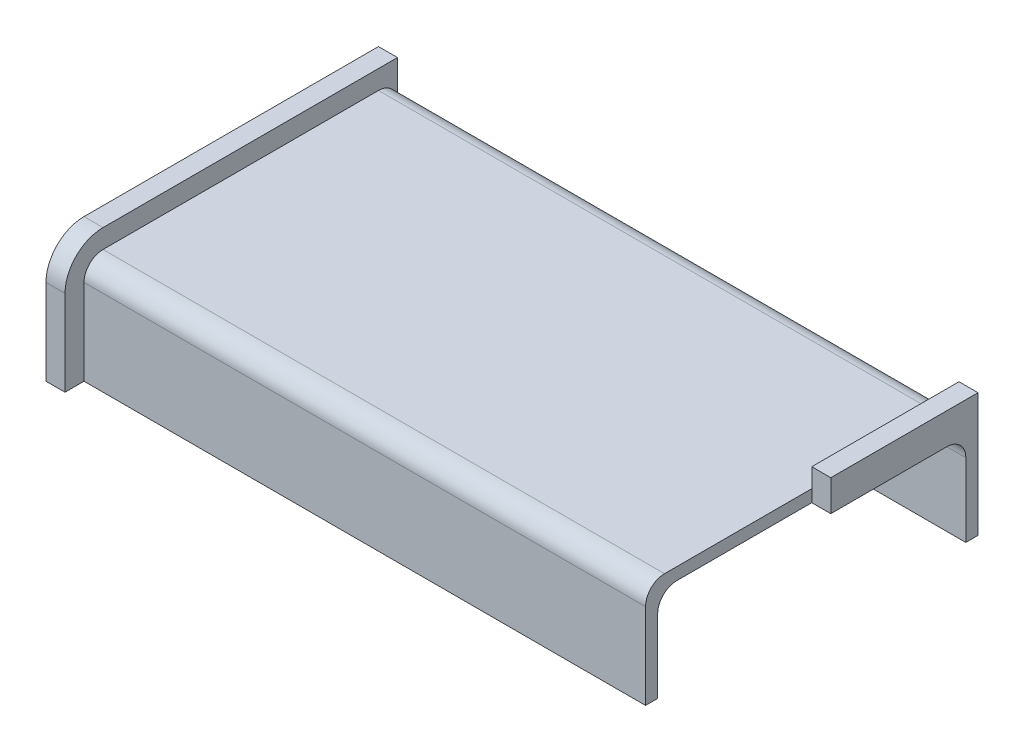
ISO-10303-21;
HEADER;
FILE_DESCRIPTION(('STEP AP214'),'2;1');
FILE_NAME('part.step','',(''),(''),'','','');
FILE_SCHEMA(('AUTOMOTIVE_DESIGN { 1 0 10303 214 1 1 1 1 }'));
ENDSEC;
DATA;
#1=APPLICATION_CONTEXT('core data for automotive mechanical design processes');
#2=APPLICATION_PROTOCOL_DEFINITION('international standard','automotive_design',2000,#1);
#3=PRODUCT_CONTEXT('',#1,'mechanical');
#4=PRODUCT('Part','Part','',(#3));
#5=PRODUCT_RELATED_PRODUCT_CATEGORY('part','',(#4));
#6=PRODUCT_DEFINITION_FORMATION('','',#4);
#7=PRODUCT_DEFINITION_CONTEXT('part definition',#1,'design');
#8=PRODUCT_DEFINITION('design','',#6,#7);
#9=PRODUCT_DEFINITION_SHAPE('','',#8);
#10=(LENGTH_UNIT() NAMED_UNIT(*) SI_UNIT(.MILLI.,.METRE.));
#11=(NAMED_UNIT(*) PLANE_ANGLE_UNIT() SI_UNIT($,.RADIAN.));
#12=(NAMED_UNIT(*) SI_UNIT($,.STERADIAN.) SOLID_ANGLE_UNIT());
#13=UNCERTAINTY_MEASURE_WITH_UNIT(LENGTH_MEASURE(1.E-05),#10,'distance_accuracy_value','');
#14=(GEOMETRIC_REPRESENTATION_CONTEXT(3) GLOBAL_UNCERTAINTY_ASSIGNED_CONTEXT((#13)) GLOBAL_UNIT_ASSIGNED_CONTEXT((#10,
#11,#12)) REPRESENTATION_CONTEXT('',''));
#15=CARTESIAN_POINT('',(0.,0.,0.));
#16=DIRECTION('',(0.,0.,1.));
#17=DIRECTION('',(1.,0.,0.));
#18=AXIS2_PLACEMENT_3D('',#15,#16,#17);
#19=CARTESIAN_POINT('',(46.863,12.2555,-5.207));
#20=DIRECTION('',(1.,0.,0.));
#21=DIRECTION('',(0.,0.,-1.));
#22=AXIS2_PLACEMENT_3D('',#19,#20,#21);
#23=CYLINDRICAL_SURFACE('',#22,3.175);
#24=DIRECTION('',(-1.,0.,0.));
#25=VECTOR('',#24,1.);
#26=CARTESIAN_POINT('',(46.863,15.4305,-5.207));
#27=LINE('',#26,#25);
#28=CARTESIAN_POINT('',(46.863,15.4305,-5.207));
#29=VERTEX_POINT('',#28);
#30=CARTESIAN_POINT('',(-50.038,15.4305,-5.207));
#31=VERTEX_POINT('',#30);
#32=EDGE_CURVE('E297',#29,#31,#27,.T.);
#33=ORIENTED_EDGE('',*,*,#32,.F.);
#34=CARTESIAN_POINT('',(46.863,12.2555,-5.207));
#35=DIRECTION('',(-1.,0.,0.));
#36=DIRECTION('',(0.,0.,1.));
#37=AXIS2_PLACEMENT_3D('',#34,#35,#36);
#38=CIRCLE('',#37,3.175);
#39=CARTESIAN_POINT('',(46.863,12.2555,-2.032));
#40=VERTEX_POINT('',#39);
#41=EDGE_CURVE('E406',#29,#40,#38,.F.);
#42=ORIENTED_EDGE('',*,*,#41,.T.);
#43=DIRECTION('',(-1.,0.,0.));
#44=VECTOR('',#43,1.);
#45=CARTESIAN_POINT('',(46.863,12.2555,-2.032));
#46=LINE('',#45,#44);
#47=CARTESIAN_POINT('',(-50.038,12.2555,-2.032));
#48=VERTEX_POINT('',#47);
#49=EDGE_CURVE('E300',#48,#40,#46,.F.);
#50=ORIENTED_EDGE('',*,*,#49,.F.);
#51=CARTESIAN_POINT('',(-50.038,12.2555,-5.207));
#52=DIRECTION('',(-1.,0.,0.));
#53=DIRECTION('',(0.,0.,1.));
#54=AXIS2_PLACEMENT_3D('',#51,#52,#53);
#55=CIRCLE('',#54,3.175);
#56=EDGE_CURVE('E53',#48,#31,#55,.T.);
#57=ORIENTED_EDGE('',*,*,#56,.T.);
#58=EDGE_LOOP('',(#33,#42,#50,#57));
#59=FACE_BOUND('',#58,.T.);
#60=ADVANCED_FACE('F45',(#59),#23,.F.);
#61=CARTESIAN_POINT('',(46.863,12.2555,-47.117));
#62=DIRECTION('',(1.,0.,0.));
#63=DIRECTION('',(0.,0.,-1.));
#64=AXIS2_PLACEMENT_3D('',#61,#62,#63);
#65=CYLINDRICAL_SURFACE('',#64,3.175);
#66=DIRECTION('',(-1.,0.,0.));
#67=VECTOR('',#66,1.);
#68=CARTESIAN_POINT('',(46.863,12.2555,-50.292));
#69=LINE('',#68,#67);
#70=CARTESIAN_POINT('',(50.038,12.2555,-50.292));
#71=VERTEX_POINT('',#70);
#72=CARTESIAN_POINT('',(-50.038,12.2555,-50.292));
#73=VERTEX_POINT('',#72);
#74=EDGE_CURVE('E282',#71,#73,#69,.T.);
#75=ORIENTED_EDGE('',*,*,#74,.F.);
#76=CARTESIAN_POINT('',(50.038,12.2555,-47.117));
#77=DIRECTION('',(1.,0.,0.));
#78=DIRECTION('',(0.,0.,-1.));
#79=AXIS2_PLACEMENT_3D('',#76,#77,#78);
#80=CIRCLE('',#79,3.175);
#81=CARTESIAN_POINT('',(50.038,15.4305,-47.117));
#82=VERTEX_POINT('',#81);
#83=EDGE_CURVE('E290',#71,#82,#80,.T.);
#84=ORIENTED_EDGE('',*,*,#83,.T.);
#85=DIRECTION('',(-1.,0.,0.));
#86=VECTOR('',#85,1.);
#87=CARTESIAN_POINT('',(46.863,15.4305,-47.117));
#88=LINE('',#87,#86);
#89=CARTESIAN_POINT('',(-50.038,15.4305,-47.117));
#90=VERTEX_POINT('',#89);
#91=EDGE_CURVE('E286',#90,#82,#88,.F.);
#92=ORIENTED_EDGE('',*,*,#91,.F.);
#93=CARTESIAN_POINT('',(-50.038,12.2555,-47.117));
#94=DIRECTION('',(-1.,0.,0.));
#95=DIRECTION('',(0.,0.,1.));
#96=AXIS2_PLACEMENT_3D('',#93,#94,#95);
#97=CIRCLE('',#96,3.175);
#98=EDGE_CURVE('E294',#90,#73,#97,.T.);
#99=ORIENTED_EDGE('',*,*,#98,.T.);
#100=EDGE_LOOP('',(#75,#84,#92,#99));
#101=FACE_BOUND('',#100,.T.);
#102=ADVANCED_FACE('F456',(#101),#65,.F.);
#103=CARTESIAN_POINT('',(46.863,0.,0.));
#104=DIRECTION('',(0.,0.,-1.));
#105=DIRECTION('',(-1.,0.,0.));
#106=AXIS2_PLACEMENT_3D('',#103,#104,#105);
#107=PLANE('',#106);
#108=DIRECTION('',(0.,-1.,0.));
#109=VECTOR('',#108,1.);
#110=CARTESIAN_POINT('',(-46.863,0.,0.));
#111=LINE('',#110,#109);
#112=CARTESIAN_POINT('',(-46.863,14.2875,0.));
#113=VERTEX_POINT('',#112);
#114=CARTESIAN_POINT('',(-46.863,0.,0.));
#115=VERTEX_POINT('',#114);
#116=EDGE_CURVE('E209',#113,#115,#111,.T.);
#117=ORIENTED_EDGE('',*,*,#116,.T.);
#118=DIRECTION('',(-1.,0.,0.));
#119=VECTOR('',#118,1.);
#120=CARTESIAN_POINT('',(46.863,0.,0.));
#121=LINE('',#120,#119);
#122=CARTESIAN_POINT('',(46.863,0.,0.));
#123=VERTEX_POINT('',#122);
#124=EDGE_CURVE('E278',#123,#115,#121,.T.);
#125=ORIENTED_EDGE('',*,*,#124,.F.);
#126=DIRECTION('',(0.,-1.,0.));
#127=VECTOR('',#126,1.);
#128=CARTESIAN_POINT('',(46.863,0.,0.));
#129=LINE('',#128,#127);
#130=CARTESIAN_POINT('',(46.863,14.2875,0.));
#131=VERTEX_POINT('',#130);
#132=EDGE_CURVE('E222',#131,#123,#129,.T.);
#133=ORIENTED_EDGE('',*,*,#132,.F.);
#134=DIRECTION('',(-1.,0.,0.));
#135=VECTOR('',#134,1.);
#136=CARTESIAN_POINT('',(46.863,14.2875,0.));
#137=LINE('',#136,#135);
#138=EDGE_CURVE('E238',#131,#113,#137,.T.);
#139=ORIENTED_EDGE('',*,*,#138,.T.);
#140=EDGE_LOOP('',(#117,#125,#133,#139));
#141=FACE_BOUND('',#140,.T.);
#142=ADVANCED_FACE('F391',(#141),#107,.F.);
#143=CARTESIAN_POINT('',(46.863,0.,-2.032));
#144=DIRECTION('',(0.,-1.,0.));
#145=DIRECTION('',(0.,0.,-1.));
#146=AXIS2_PLACEMENT_3D('',#143,#144,#145);
#147=PLANE('',#146);
#148=DIRECTION('',(0.,0.,-1.));
#149=VECTOR('',#148,1.);
#150=CARTESIAN_POINT('',(46.863,0.,-27.7495));
#151=LINE('',#150,#149);
#152=CARTESIAN_POINT('',(46.863,0.,-2.03200000000001));
#153=VERTEX_POINT('',#152);
#154=EDGE_CURVE('E197',#123,#153,#151,.T.);
#155=ORIENTED_EDGE('',*,*,#154,.F.);
#156=ORIENTED_EDGE('',*,*,#124,.T.);
#157=DIRECTION('',(0.,0.,-1.));
#158=VECTOR('',#157,1.);
#159=CARTESIAN_POINT('',(-46.863,0.,3.175));
#160=LINE('',#159,#158);
#161=CARTESIAN_POINT('',(-46.863,0.,3.175));
#162=VERTEX_POINT('',#161);
#163=EDGE_CURVE('E327',#162,#115,#160,.T.);
#164=ORIENTED_EDGE('',*,*,#163,.F.);
#165=DIRECTION('',(1.,0.,0.));
#166=VECTOR('',#165,1.);
#167=CARTESIAN_POINT('',(-50.038,0.,3.175));
#168=LINE('',#167,#166);
#169=CARTESIAN_POINT('',(-50.038,0.,3.175));
#170=VERTEX_POINT('',#169);
#171=EDGE_CURVE('E218',#170,#162,#168,.T.);
#172=ORIENTED_EDGE('',*,*,#171,.F.);
#173=DIRECTION('',(0.,0.,-1.));
#174=VECTOR('',#173,1.);
#175=CARTESIAN_POINT('',(-50.038,0.,0.));
#176=LINE('',#175,#174);
#177=CARTESIAN_POINT('',(-50.038,0.,-2.032));
#178=VERTEX_POINT('',#177);
#179=EDGE_CURVE('E413',#170,#178,#176,.T.);
#180=ORIENTED_EDGE('',*,*,#179,.T.);
#181=DIRECTION('',(-1.,0.,0.));
#182=VECTOR('',#181,1.);
#183=CARTESIAN_POINT('',(46.863,0.,-2.032));
#184=LINE('',#183,#182);
#185=EDGE_CURVE('E275',#153,#178,#184,.T.);
#186=ORIENTED_EDGE('',*,*,#185,.F.);
#187=EDGE_LOOP('',(#155,#156,#164,#172,#180,#186));
#188=FACE_BOUND('',#187,.T.);
#189=ADVANCED_FACE('F394',(#188),#147,.T.);
#190=CARTESIAN_POINT('',(46.863,0.,-2.032));
#191=DIRECTION('',(0.,0.,-1.));
#192=DIRECTION('',(-1.,0.,0.));
#193=AXIS2_PLACEMENT_3D('',#190,#191,#192);
#194=PLANE('',#193);
#195=DIRECTION('',(0.,1.,0.));
#196=VECTOR('',#195,1.);
#197=CARTESIAN_POINT('',(46.863,0.,-2.032));
#198=LINE('',#197,#196);
#199=EDGE_CURVE('E331',#153,#40,#198,.T.);
#200=ORIENTED_EDGE('',*,*,#199,.F.);
#201=ORIENTED_EDGE('',*,*,#185,.T.);
#202=DIRECTION('',(0.,1.,0.));
#203=VECTOR('',#202,1.);
#204=CARTESIAN_POINT('',(-50.038,0.,-2.032));
#205=LINE('',#204,#203);
#206=EDGE_CURVE('E345',#178,#48,#205,.T.);
#207=ORIENTED_EDGE('',*,*,#206,.T.);
#208=ORIENTED_EDGE('',*,*,#49,.T.);
#209=EDGE_LOOP('',(#200,#201,#207,#208));
#210=FACE_BOUND('',#209,.T.);
#211=ADVANCED_FACE('F472',(#210),#194,.T.);
#212=CARTESIAN_POINT('',(46.863,15.4305,-3.17500000000002));
#213=DIRECTION('',(0.,-1.,0.));
#214=DIRECTION('',(0.,0.,-1.));
#215=AXIS2_PLACEMENT_3D('',#212,#213,#214);
#216=PLANE('',#215);
#217=DIRECTION('',(1.,0.,0.));
#218=VECTOR('',#217,1.);
#219=CARTESIAN_POINT('',(46.863,15.4305,-27.7495));
#220=LINE('',#219,#218);
#221=CARTESIAN_POINT('',(46.863,15.4305,-27.7495));
#222=VERTEX_POINT('',#221);
#223=CARTESIAN_POINT('',(50.038,15.4305,-27.7495));
#224=VERTEX_POINT('',#223);
#225=EDGE_CURVE('E181',#222,#224,#220,.T.);
#226=ORIENTED_EDGE('',*,*,#225,.F.);
#227=DIRECTION('',(0.,0.,-1.));
#228=VECTOR('',#227,1.);
#229=CARTESIAN_POINT('',(46.863,15.4305,-3.17500000000002));
#230=LINE('',#229,#228);
#231=EDGE_CURVE('E377',#29,#222,#230,.T.);
#232=ORIENTED_EDGE('',*,*,#231,.F.);
#233=ORIENTED_EDGE('',*,*,#32,.T.);
#234=DIRECTION('',(0.,0.,-1.));
#235=VECTOR('',#234,1.);
#236=CARTESIAN_POINT('',(-50.038,15.4305,-3.17500000000001));
#237=LINE('',#236,#235);
#238=EDGE_CURVE('E309',#31,#90,#237,.T.);
#239=ORIENTED_EDGE('',*,*,#238,.T.);
#240=ORIENTED_EDGE('',*,*,#91,.T.);
#241=DIRECTION('',(0.,0.,-1.));
#242=VECTOR('',#241,1.);
#243=CARTESIAN_POINT('',(50.038,15.4305,-3.17500000000001));
#244=LINE('',#243,#242);
#245=EDGE_CURVE('E220',#224,#82,#244,.T.);
#246=ORIENTED_EDGE('',*,*,#245,.F.);
#247=EDGE_LOOP('',(#226,#232,#233,#239,#240,#246));
#248=FACE_BOUND('',#247,.T.);
#249=ADVANCED_FACE('F475',(#248),#216,.T.);
#250=CARTESIAN_POINT('',(46.863,0.,-50.292));
#251=DIRECTION('',(0.,0.,1.));
#252=DIRECTION('',(1.,0.,0.));
#253=AXIS2_PLACEMENT_3D('',#250,#251,#252);
#254=PLANE('',#253);
#255=DIRECTION('',(0.,-1.,0.));
#256=VECTOR('',#255,1.);
#257=CARTESIAN_POINT('',(50.038,14.2875,-50.292));
#258=LINE('',#257,#256);
#259=CARTESIAN_POINT('',(50.038,0.,-50.292));
#260=VERTEX_POINT('',#259);
#261=EDGE_CURVE('E356',#71,#260,#258,.T.);
#262=ORIENTED_EDGE('',*,*,#261,.F.);
#263=ORIENTED_EDGE('',*,*,#74,.T.);
#264=DIRECTION('',(0.,-1.,0.));
#265=VECTOR('',#264,1.);
#266=CARTESIAN_POINT('',(-50.038,14.2875,-50.292));
#267=LINE('',#266,#265);
#268=CARTESIAN_POINT('',(-50.038,0.,-50.292));
#269=VERTEX_POINT('',#268);
#270=EDGE_CURVE('E316',#73,#269,#267,.T.);
#271=ORIENTED_EDGE('',*,*,#270,.T.);
#272=DIRECTION('',(-1.,0.,0.));
#273=VECTOR('',#272,1.);
#274=CARTESIAN_POINT('',(46.863,0.,-50.292));
#275=LINE('',#274,#273);
#276=EDGE_CURVE('E271',#260,#269,#275,.T.);
#277=ORIENTED_EDGE('',*,*,#276,.F.);
#278=EDGE_LOOP('',(#262,#263,#271,#277));
#279=FACE_BOUND('',#278,.T.);
#280=ADVANCED_FACE('F479',(#279),#254,.T.);
#281=CARTESIAN_POINT('',(46.863,0.,-52.324));
#282=DIRECTION('',(0.,-1.,0.));
#283=DIRECTION('',(0.,0.,-1.));
#284=AXIS2_PLACEMENT_3D('',#281,#282,#283);
#285=PLANE('',#284);
#286=ORIENTED_EDGE('',*,*,#276,.T.);
#287=DIRECTION('',(0.,0.,-1.));
#288=VECTOR('',#287,1.);
#289=CARTESIAN_POINT('',(-50.038,0.,-50.292));
#290=LINE('',#289,#288);
#291=CARTESIAN_POINT('',(-50.038,0.,-52.324));
#292=VERTEX_POINT('',#291);
#293=EDGE_CURVE('E323',#269,#292,#290,.T.);
#294=ORIENTED_EDGE('',*,*,#293,.T.);
#295=DIRECTION('',(-1.,0.,0.));
#296=VECTOR('',#295,1.);
#297=CARTESIAN_POINT('',(46.863,0.,-52.324));
#298=LINE('',#297,#296);
#299=CARTESIAN_POINT('',(50.038,0.,-52.324));
#300=VERTEX_POINT('',#299);
#301=EDGE_CURVE('E268',#300,#292,#298,.T.);
#302=ORIENTED_EDGE('',*,*,#301,.F.);
#303=DIRECTION('',(0.,0.,-1.));
#304=VECTOR('',#303,1.);
#305=CARTESIAN_POINT('',(50.038,0.,-50.292));
#306=LINE('',#305,#304);
#307=EDGE_CURVE('E211',#260,#300,#306,.T.);
#308=ORIENTED_EDGE('',*,*,#307,.F.);
#309=EDGE_LOOP('',(#286,#294,#302,#308));
#310=FACE_BOUND('',#309,.T.);
#311=ADVANCED_FACE('F433',(#310),#285,.T.);
#312=CARTESIAN_POINT('',(46.863,0.,-52.324));
#313=DIRECTION('',(0.,0.,1.));
#314=DIRECTION('',(1.,0.,0.));
#315=AXIS2_PLACEMENT_3D('',#312,#313,#314);
#316=PLANE('',#315);
#317=ORIENTED_EDGE('',*,*,#301,.T.);
#318=DIRECTION('',(0.,1.,0.));
#319=VECTOR('',#318,1.);
#320=CARTESIAN_POINT('',(-50.038,14.2875,-52.324));
#321=LINE('',#320,#319);
#322=CARTESIAN_POINT('',(-50.038,20.6375,-52.324));
#323=VERTEX_POINT('',#322);
#324=EDGE_CURVE('E428',#292,#323,#321,.T.);
#325=ORIENTED_EDGE('',*,*,#324,.T.);
#326=DIRECTION('',(1.,0.,0.));
#327=VECTOR('',#326,1.);
#328=CARTESIAN_POINT('',(-50.038,20.6375,-52.324));
#329=LINE('',#328,#327);
#330=CARTESIAN_POINT('',(-46.863,20.6375,-52.324));
#331=VERTEX_POINT('',#330);
#332=EDGE_CURVE('E315',#323,#331,#329,.T.);
#333=ORIENTED_EDGE('',*,*,#332,.T.);
#334=DIRECTION('',(0.,1.,0.));
#335=VECTOR('',#334,1.);
#336=CARTESIAN_POINT('',(-46.863,0.,-52.324));
#337=LINE('',#336,#335);
#338=CARTESIAN_POINT('',(-46.863,14.2875,-52.324));
#339=VERTEX_POINT('',#338);
#340=EDGE_CURVE('E343',#339,#331,#337,.T.);
#341=ORIENTED_EDGE('',*,*,#340,.F.);
#342=DIRECTION('',(-1.,0.,0.));
#343=VECTOR('',#342,1.);
#344=CARTESIAN_POINT('',(46.863,14.2875,-52.324));
#345=LINE('',#344,#343);
#346=CARTESIAN_POINT('',(46.863,14.2875,-52.324));
#347=VERTEX_POINT('',#346);
#348=EDGE_CURVE('E264',#347,#339,#345,.T.);
#349=ORIENTED_EDGE('',*,*,#348,.F.);
#350=DIRECTION('',(0.,1.,0.));
#351=VECTOR('',#350,1.);
#352=CARTESIAN_POINT('',(46.863,14.2875,-52.324));
#353=LINE('',#352,#351);
#354=CARTESIAN_POINT('',(46.863,20.6375,-52.324));
#355=VERTEX_POINT('',#354);
#356=EDGE_CURVE('E215',#347,#355,#353,.T.);
#357=ORIENTED_EDGE('',*,*,#356,.T.);
#358=DIRECTION('',(-1.,0.,0.));
#359=VECTOR('',#358,1.);
#360=CARTESIAN_POINT('',(50.038,20.6375,-52.324));
#361=LINE('',#360,#359);
#362=CARTESIAN_POINT('',(50.038,20.6375,-52.324));
#363=VERTEX_POINT('',#362);
#364=EDGE_CURVE('E205',#363,#355,#361,.T.);
#365=ORIENTED_EDGE('',*,*,#364,.F.);
#366=DIRECTION('',(0.,1.,0.));
#367=VECTOR('',#366,1.);
#368=CARTESIAN_POINT('',(50.038,0.,-52.324));
#369=LINE('',#368,#367);
#370=EDGE_CURVE('E202',#300,#363,#369,.T.);
#371=ORIENTED_EDGE('',*,*,#370,.F.);
#372=EDGE_LOOP('',(#317,#325,#333,#341,#349,#357,#365,#371));
#373=FACE_BOUND('',#372,.T.);
#374=ADVANCED_FACE('F364',(#373),#316,.F.);
#375=CARTESIAN_POINT('',(46.863,14.2875,-49.149));
#376=DIRECTION('',(-1.,0.,0.));
#377=DIRECTION('',(0.,0.,1.));
#378=AXIS2_PLACEMENT_3D('',#375,#376,#377);
#379=CYLINDRICAL_SURFACE('',#378,3.175);
#380=CARTESIAN_POINT('',(-46.863,14.2875,-49.149));
#381=DIRECTION('',(1.,0.,0.));
#382=DIRECTION('',(0.,0.,1.));
#383=AXIS2_PLACEMENT_3D('',#380,#381,#382);
#384=CIRCLE('',#383,3.175);
#385=CARTESIAN_POINT('',(-46.863,17.4625,-49.149));
#386=VERTEX_POINT('',#385);
#387=EDGE_CURVE('E242',#339,#386,#384,.T.);
#388=ORIENTED_EDGE('',*,*,#387,.T.);
#389=DIRECTION('',(-1.,0.,0.));
#390=VECTOR('',#389,1.);
#391=CARTESIAN_POINT('',(46.863,17.4625,-49.149));
#392=LINE('',#391,#390);
#393=CARTESIAN_POINT('',(46.863,17.4625,-49.149));
#394=VERTEX_POINT('',#393);
#395=EDGE_CURVE('E260',#394,#386,#392,.T.);
#396=ORIENTED_EDGE('',*,*,#395,.F.);
#397=CARTESIAN_POINT('',(46.863,14.2875,-49.149));
#398=DIRECTION('',(1.,0.,0.));
#399=DIRECTION('',(0.,0.,1.));
#400=AXIS2_PLACEMENT_3D('',#397,#398,#399);
#401=CIRCLE('',#400,3.175);
#402=EDGE_CURVE('E225',#347,#394,#401,.T.);
#403=ORIENTED_EDGE('',*,*,#402,.F.);
#404=ORIENTED_EDGE('',*,*,#348,.T.);
#405=EDGE_LOOP('',(#388,#396,#403,#404));
#406=FACE_BOUND('',#405,.T.);
#407=ADVANCED_FACE('F444',(#406),#379,.T.);
#408=CARTESIAN_POINT('',(46.863,17.4625,-3.17500000000002));
#409=DIRECTION('',(0.,-1.,0.));
#410=DIRECTION('',(0.,0.,-1.));
#411=AXIS2_PLACEMENT_3D('',#408,#409,#410);
#412=PLANE('',#411);
#413=DIRECTION('',(0.,0.,1.));
#414=VECTOR('',#413,1.);
#415=CARTESIAN_POINT('',(-46.863,17.4625,-3.17500000000002));
#416=LINE('',#415,#414);
#417=CARTESIAN_POINT('',(-46.863,17.4625,-3.17500000000002));
#418=VERTEX_POINT('',#417);
#419=EDGE_CURVE('E246',#386,#418,#416,.T.);
#420=ORIENTED_EDGE('',*,*,#419,.T.);
#421=DIRECTION('',(-1.,0.,0.));
#422=VECTOR('',#421,1.);
#423=CARTESIAN_POINT('',(46.863,17.4625,-3.17500000000002));
#424=LINE('',#423,#422);
#425=CARTESIAN_POINT('',(46.863,17.4625,-3.17500000000002));
#426=VERTEX_POINT('',#425);
#427=EDGE_CURVE('E256',#426,#418,#424,.T.);
#428=ORIENTED_EDGE('',*,*,#427,.F.);
#429=DIRECTION('',(0.,0.,1.));
#430=VECTOR('',#429,1.);
#431=CARTESIAN_POINT('',(46.863,17.4625,-3.17500000000002));
#432=LINE('',#431,#430);
#433=CARTESIAN_POINT('',(46.863,17.4625,-27.7495));
#434=VERTEX_POINT('',#433);
#435=EDGE_CURVE('E230',#434,#426,#432,.T.);
#436=ORIENTED_EDGE('',*,*,#435,.F.);
#437=EDGE_CURVE('E231',#394,#434,#432,.T.);
#438=ORIENTED_EDGE('',*,*,#437,.F.);
#439=ORIENTED_EDGE('',*,*,#395,.T.);
#440=EDGE_LOOP('',(#420,#428,#436,#438,#439));
#441=FACE_BOUND('',#440,.T.);
#442=ADVANCED_FACE('F381',(#441),#412,.F.);
#443=CARTESIAN_POINT('',(46.863,14.2875,-3.175));
#444=DIRECTION('',(-1.,0.,0.));
#445=DIRECTION('',(0.,0.,1.));
#446=AXIS2_PLACEMENT_3D('',#443,#444,#445);
#447=CYLINDRICAL_SURFACE('',#446,3.175);
#448=CARTESIAN_POINT('',(-46.863,14.2875,-3.175));
#449=DIRECTION('',(1.,0.,0.));
#450=DIRECTION('',(0.,0.,1.));
#451=AXIS2_PLACEMENT_3D('',#448,#449,#450);
#452=CIRCLE('',#451,3.175);
#453=EDGE_CURVE('E226',#418,#113,#452,.T.);
#454=ORIENTED_EDGE('',*,*,#453,.T.);
#455=ORIENTED_EDGE('',*,*,#138,.F.);
#456=CARTESIAN_POINT('',(46.863,14.2875,-3.175));
#457=DIRECTION('',(1.,0.,0.));
#458=DIRECTION('',(0.,0.,1.));
#459=AXIS2_PLACEMENT_3D('',#456,#457,#458);
#460=CIRCLE('',#459,3.175);
#461=EDGE_CURVE('E235',#426,#131,#460,.T.);
#462=ORIENTED_EDGE('',*,*,#461,.F.);
#463=ORIENTED_EDGE('',*,*,#427,.T.);
#464=EDGE_LOOP('',(#454,#455,#462,#463));
#465=FACE_BOUND('',#464,.T.);
#466=ADVANCED_FACE('F386',(#465),#447,.T.);
#467=CARTESIAN_POINT('',(50.038,20.6375,-52.324));
#468=DIRECTION('',(0.,-1.,0.));
#469=DIRECTION('',(0.,0.,-1.));
#470=AXIS2_PLACEMENT_3D('',#467,#468,#469);
#471=PLANE('',#470);
#472=DIRECTION('',(0.,0.,1.));
#473=VECTOR('',#472,1.);
#474=CARTESIAN_POINT('',(46.863,20.6375,-52.324));
#475=LINE('',#474,#473);
#476=CARTESIAN_POINT('',(46.863,20.6375,-27.7495));
#477=VERTEX_POINT('',#476);
#478=EDGE_CURVE('E195',#355,#477,#475,.T.);
#479=ORIENTED_EDGE('',*,*,#478,.T.);
#480=DIRECTION('',(1.,0.,0.));
#481=VECTOR('',#480,1.);
#482=CARTESIAN_POINT('',(46.863,20.6375,-27.7495));
#483=LINE('',#482,#481);
#484=CARTESIAN_POINT('',(50.038,20.6375,-27.7495));
#485=VERTEX_POINT('',#484);
#486=EDGE_CURVE('E60',#477,#485,#483,.T.);
#487=ORIENTED_EDGE('',*,*,#486,.T.);
#488=DIRECTION('',(0.,0.,1.));
#489=VECTOR('',#488,1.);
#490=CARTESIAN_POINT('',(50.038,20.6375,-52.324));
#491=LINE('',#490,#489);
#492=EDGE_CURVE('E193',#363,#485,#491,.T.);
#493=ORIENTED_EDGE('',*,*,#492,.F.);
#494=ORIENTED_EDGE('',*,*,#364,.T.);
#495=EDGE_LOOP('',(#479,#487,#493,#494));
#496=FACE_BOUND('',#495,.T.);
#497=ADVANCED_FACE('F191',(#496),#471,.F.);
#498=CARTESIAN_POINT('',(50.038,14.2875,-3.175));
#499=DIRECTION('',(1.,0.,0.));
#500=DIRECTION('',(0.,0.,-1.));
#501=AXIS2_PLACEMENT_3D('',#498,#499,#500);
#502=PLANE('',#501);
#503=DIRECTION('',(0.,1.,0.));
#504=VECTOR('',#503,1.);
#505=CARTESIAN_POINT('',(50.038,20.6375,-27.7495));
#506=LINE('',#505,#504);
#507=EDGE_CURVE('E177',#224,#485,#506,.T.);
#508=ORIENTED_EDGE('',*,*,#507,.F.);
#509=ORIENTED_EDGE('',*,*,#245,.T.);
#510=ORIENTED_EDGE('',*,*,#83,.F.);
#511=ORIENTED_EDGE('',*,*,#261,.T.);
#512=ORIENTED_EDGE('',*,*,#307,.T.);
#513=ORIENTED_EDGE('',*,*,#370,.T.);
#514=ORIENTED_EDGE('',*,*,#492,.T.);
#515=EDGE_LOOP('',(#508,#509,#510,#511,#512,#513,#514));
#516=FACE_BOUND('',#515,.T.);
#517=ADVANCED_FACE('F199',(#516),#502,.T.);
#518=CARTESIAN_POINT('',(46.863,14.2875,-3.175));
#519=DIRECTION('',(1.,0.,0.));
#520=DIRECTION('',(0.,0.,-1.));
#521=AXIS2_PLACEMENT_3D('',#518,#519,#520);
#522=PLANE('',#521);
#523=ORIENTED_EDGE('',*,*,#437,.T.);
#524=DIRECTION('',(0.,1.,0.));
#525=VECTOR('',#524,1.);
#526=CARTESIAN_POINT('',(46.863,14.2875,-27.7495));
#527=LINE('',#526,#525);
#528=EDGE_CURVE('E11',#434,#477,#527,.T.);
#529=ORIENTED_EDGE('',*,*,#528,.T.);
#530=ORIENTED_EDGE('',*,*,#478,.F.);
#531=ORIENTED_EDGE('',*,*,#356,.F.);
#532=ORIENTED_EDGE('',*,*,#402,.T.);
#533=EDGE_LOOP('',(#523,#529,#530,#531,#532));
#534=FACE_BOUND('',#533,.T.);
#535=ADVANCED_FACE('F369',(#534),#522,.F.);
#536=CARTESIAN_POINT('',(-50.038,14.2875,3.175));
#537=DIRECTION('',(0.,0.,1.));
#538=DIRECTION('',(1.,0.,0.));
#539=AXIS2_PLACEMENT_3D('',#536,#537,#538);
#540=PLANE('',#539);
#541=DIRECTION('',(0.,-1.,0.));
#542=VECTOR('',#541,1.);
#543=CARTESIAN_POINT('',(-46.863,14.2875,3.175));
#544=LINE('',#543,#542);
#545=CARTESIAN_POINT('',(-46.863,14.2875,3.175));
#546=VERTEX_POINT('',#545);
#547=EDGE_CURVE('E330',#546,#162,#544,.T.);
#548=ORIENTED_EDGE('',*,*,#547,.F.);
#549=DIRECTION('',(1.,0.,0.));
#550=VECTOR('',#549,1.);
#551=CARTESIAN_POINT('',(-50.038,14.2875,3.175));
#552=LINE('',#551,#550);
#553=CARTESIAN_POINT('',(-50.038,14.2875,3.175));
#554=VERTEX_POINT('',#553);
#555=EDGE_CURVE('E349',#554,#546,#552,.T.);
#556=ORIENTED_EDGE('',*,*,#555,.F.);
#557=DIRECTION('',(0.,-1.,0.));
#558=VECTOR('',#557,1.);
#559=CARTESIAN_POINT('',(-50.038,14.2875,3.175));
#560=LINE('',#559,#558);
#561=EDGE_CURVE('E416',#554,#170,#560,.T.);
#562=ORIENTED_EDGE('',*,*,#561,.T.);
#563=ORIENTED_EDGE('',*,*,#171,.T.);
#564=EDGE_LOOP('',(#548,#556,#562,#563));
#565=FACE_BOUND('',#564,.T.);
#566=ADVANCED_FACE('F498',(#565),#540,.T.);
#567=CARTESIAN_POINT('',(-50.038,14.2875,-3.175));
#568=DIRECTION('',(1.,0.,0.));
#569=DIRECTION('',(0.,0.,-1.));
#570=AXIS2_PLACEMENT_3D('',#567,#568,#569);
#571=CYLINDRICAL_SURFACE('',#570,6.35);
#572=CARTESIAN_POINT('',(-46.863,14.2875,-3.175));
#573=DIRECTION('',(1.,0.,0.));
#574=DIRECTION('',(0.,0.,-1.));
#575=AXIS2_PLACEMENT_3D('',#572,#573,#574);
#576=CIRCLE('',#575,6.35);
#577=CARTESIAN_POINT('',(-46.863,20.6375,-3.17500000000002));
#578=VERTEX_POINT('',#577);
#579=EDGE_CURVE('E335',#578,#546,#576,.T.);
#580=ORIENTED_EDGE('',*,*,#579,.F.);
#581=DIRECTION('',(1.,0.,0.));
#582=VECTOR('',#581,1.);
#583=CARTESIAN_POINT('',(-50.038,20.6375,-3.17500000000002));
#584=LINE('',#583,#582);
#585=CARTESIAN_POINT('',(-50.038,20.6375,-3.17500000000002));
#586=VERTEX_POINT('',#585);
#587=EDGE_CURVE('E321',#586,#578,#584,.T.);
#588=ORIENTED_EDGE('',*,*,#587,.F.);
#589=CARTESIAN_POINT('',(-50.038,14.2875,-3.175));
#590=DIRECTION('',(1.,0.,0.));
#591=DIRECTION('',(0.,0.,-1.));
#592=AXIS2_PLACEMENT_3D('',#589,#590,#591);
#593=CIRCLE('',#592,6.35);
#594=EDGE_CURVE('E420',#586,#554,#593,.T.);
#595=ORIENTED_EDGE('',*,*,#594,.T.);
#596=ORIENTED_EDGE('',*,*,#555,.T.);
#597=EDGE_LOOP('',(#580,#588,#595,#596));
#598=FACE_BOUND('',#597,.T.);
#599=ADVANCED_FACE('F503',(#598),#571,.T.);
#600=CARTESIAN_POINT('',(-50.038,20.6375,-52.324));
#601=DIRECTION('',(0.,1.,0.));
#602=DIRECTION('',(0.,0.,1.));
#603=AXIS2_PLACEMENT_3D('',#600,#601,#602);
#604=PLANE('',#603);
#605=DIRECTION('',(0.,0.,1.));
#606=VECTOR('',#605,1.);
#607=CARTESIAN_POINT('',(-46.863,20.6375,-52.324));
#608=LINE('',#607,#606);
#609=EDGE_CURVE('E339',#331,#578,#608,.T.);
#610=ORIENTED_EDGE('',*,*,#609,.F.);
#611=ORIENTED_EDGE('',*,*,#332,.F.);
#612=DIRECTION('',(0.,0.,1.));
#613=VECTOR('',#612,1.);
#614=CARTESIAN_POINT('',(-50.038,20.6375,-52.324));
#615=LINE('',#614,#613);
#616=EDGE_CURVE('E424',#323,#586,#615,.T.);
#617=ORIENTED_EDGE('',*,*,#616,.T.);
#618=ORIENTED_EDGE('',*,*,#587,.T.);
#619=EDGE_LOOP('',(#610,#611,#617,#618));
#620=FACE_BOUND('',#619,.T.);
#621=ADVANCED_FACE('F439',(#620),#604,.T.);
#622=CARTESIAN_POINT('',(-50.038,14.2875,-3.175));
#623=DIRECTION('',(-1.,0.,0.));
#624=DIRECTION('',(0.,0.,-1.));
#625=AXIS2_PLACEMENT_3D('',#622,#623,#624);
#626=PLANE('',#625);
#627=ORIENTED_EDGE('',*,*,#56,.F.);
#628=ORIENTED_EDGE('',*,*,#206,.F.);
#629=ORIENTED_EDGE('',*,*,#179,.F.);
#630=ORIENTED_EDGE('',*,*,#561,.F.);
#631=ORIENTED_EDGE('',*,*,#594,.F.);
#632=ORIENTED_EDGE('',*,*,#616,.F.);
#633=ORIENTED_EDGE('',*,*,#324,.F.);
#634=ORIENTED_EDGE('',*,*,#293,.F.);
#635=ORIENTED_EDGE('',*,*,#270,.F.);
#636=ORIENTED_EDGE('',*,*,#98,.F.);
#637=ORIENTED_EDGE('',*,*,#238,.F.);
#638=EDGE_LOOP('',(#627,#628,#629,#630,#631,#632,#633,#634,#635,#636,#637));
#639=FACE_BOUND('',#638,.T.);
#640=ADVANCED_FACE('F310',(#639),#626,.T.);
#641=CARTESIAN_POINT('',(-46.863,14.2875,-3.175));
#642=DIRECTION('',(-1.,0.,0.));
#643=DIRECTION('',(0.,0.,-1.));
#644=AXIS2_PLACEMENT_3D('',#641,#642,#643);
#645=PLANE('',#644);
#646=ORIENTED_EDGE('',*,*,#116,.F.);
#647=ORIENTED_EDGE('',*,*,#453,.F.);
#648=ORIENTED_EDGE('',*,*,#419,.F.);
#649=ORIENTED_EDGE('',*,*,#387,.F.);
#650=ORIENTED_EDGE('',*,*,#340,.T.);
#651=ORIENTED_EDGE('',*,*,#609,.T.);
#652=ORIENTED_EDGE('',*,*,#579,.T.);
#653=ORIENTED_EDGE('',*,*,#547,.T.);
#654=ORIENTED_EDGE('',*,*,#163,.T.);
#655=EDGE_LOOP('',(#646,#647,#648,#649,#650,#651,#652,#653,#654));
#656=FACE_BOUND('',#655,.T.);
#657=ADVANCED_FACE('F442',(#656),#645,.F.);
#658=CARTESIAN_POINT('',(46.863,0.,0.));
#659=DIRECTION('',(-1.,0.,0.));
#660=DIRECTION('',(0.,0.,1.));
#661=AXIS2_PLACEMENT_3D('',#658,#659,#660);
#662=PLANE('',#661);
#663=ORIENTED_EDGE('',*,*,#199,.T.);
#664=ORIENTED_EDGE('',*,*,#41,.F.);
#665=ORIENTED_EDGE('',*,*,#231,.T.);
#666=DIRECTION('',(0.,1.,0.));
#667=VECTOR('',#666,1.);
#668=CARTESIAN_POINT('',(46.863,20.6375,-27.7495));
#669=LINE('',#668,#667);
#670=EDGE_CURVE('E186',#222,#434,#669,.T.);
#671=ORIENTED_EDGE('',*,*,#670,.T.);
#672=ORIENTED_EDGE('',*,*,#435,.T.);
#673=ORIENTED_EDGE('',*,*,#461,.T.);
#674=ORIENTED_EDGE('',*,*,#132,.T.);
#675=ORIENTED_EDGE('',*,*,#154,.T.);
#676=EDGE_LOOP('',(#663,#664,#665,#671,#672,#673,#674,#675));
#677=FACE_BOUND('',#676,.T.);
#678=ADVANCED_FACE('F374',(#677),#662,.F.);
#679=CARTESIAN_POINT('',(46.863,20.6375,-27.7495));
#680=DIRECTION('',(0.,0.,-1.));
#681=DIRECTION('',(-1.,0.,0.));
#682=AXIS2_PLACEMENT_3D('',#679,#680,#681);
#683=PLANE('',#682);
#684=ORIENTED_EDGE('',*,*,#225,.T.);
#685=ORIENTED_EDGE('',*,*,#507,.T.);
#686=ORIENTED_EDGE('',*,*,#486,.F.);
#687=ORIENTED_EDGE('',*,*,#528,.F.);
#688=ORIENTED_EDGE('',*,*,#670,.F.);
#689=EDGE_LOOP('',(#684,#685,#686,#687,#688));
#690=FACE_BOUND('',#689,.T.);
#691=ADVANCED_FACE('F178',(#690),#683,.F.);
#692=CLOSED_SHELL('',(#60,#102,#142,#189,#211,#249,#280,#311,#374,#407,#442,#466,#497,#517,#535,
#566,#599,#621,#640,#657,#678,#691));
#693=MANIFOLD_SOLID_BREP('B2',#692);
#694=ADVANCED_BREP_SHAPE_REPRESENTATION('',(#18,#693),#14);
#695=SHAPE_DEFINITION_REPRESENTATION(#9,#694);
ENDSEC;
END-ISO-10303-21;
